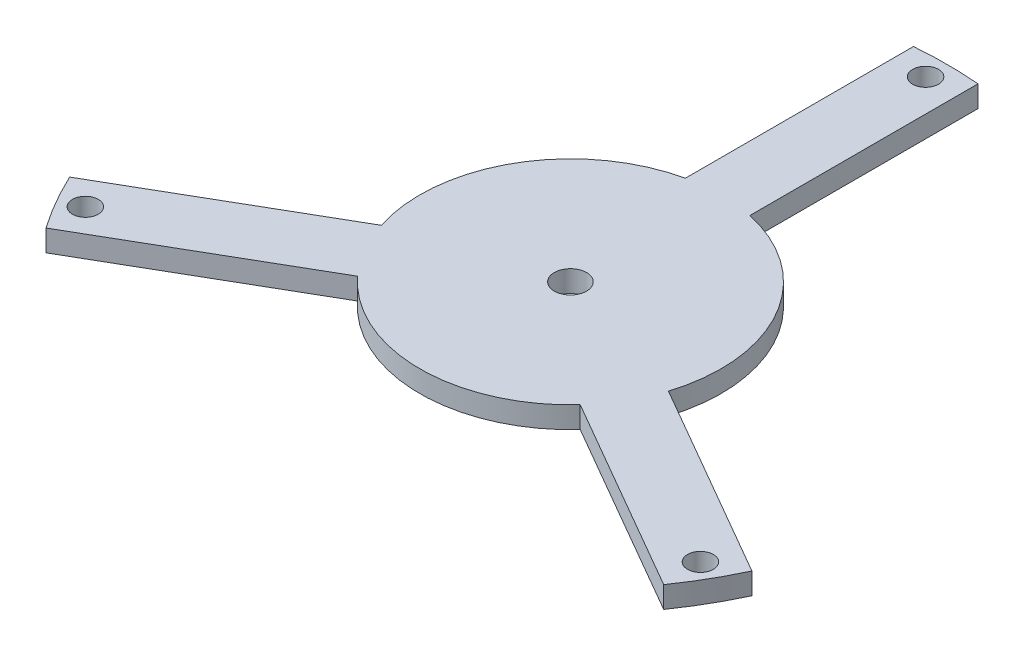
ISO-10303-21;
HEADER;
FILE_DESCRIPTION(('STEP AP214'),'2;1');
FILE_NAME('part.step','',(''),(''),'','','');
FILE_SCHEMA(('AUTOMOTIVE_DESIGN { 1 0 10303 214 1 1 1 1 }'));
ENDSEC;
DATA;
#1=APPLICATION_CONTEXT('core data for automotive mechanical design processes');
#2=APPLICATION_PROTOCOL_DEFINITION('international standard','automotive_design',2000,#1);
#3=PRODUCT_CONTEXT('',#1,'mechanical');
#4=PRODUCT('Part','Part','',(#3));
#5=PRODUCT_RELATED_PRODUCT_CATEGORY('part','',(#4));
#6=PRODUCT_DEFINITION_FORMATION('','',#4);
#7=PRODUCT_DEFINITION_CONTEXT('part definition',#1,'design');
#8=PRODUCT_DEFINITION('design','',#6,#7);
#9=PRODUCT_DEFINITION_SHAPE('','',#8);
#10=(LENGTH_UNIT() NAMED_UNIT(*) SI_UNIT(.MILLI.,.METRE.));
#11=(NAMED_UNIT(*) PLANE_ANGLE_UNIT() SI_UNIT($,.RADIAN.));
#12=(NAMED_UNIT(*) SI_UNIT($,.STERADIAN.) SOLID_ANGLE_UNIT());
#13=UNCERTAINTY_MEASURE_WITH_UNIT(LENGTH_MEASURE(1.E-05),#10,'distance_accuracy_value','');
#14=(GEOMETRIC_REPRESENTATION_CONTEXT(3) GLOBAL_UNCERTAINTY_ASSIGNED_CONTEXT((#13)) GLOBAL_UNIT_ASSIGNED_CONTEXT((#10,
#11,#12)) REPRESENTATION_CONTEXT('',''));
#15=CARTESIAN_POINT('',(0.,0.,0.));
#16=DIRECTION('',(0.,0.,1.));
#17=DIRECTION('',(1.,0.,0.));
#18=AXIS2_PLACEMENT_3D('',#15,#16,#17);
#19=CARTESIAN_POINT('',(0.,10.,0.));
#20=DIRECTION('',(0.,1.,0.));
#21=DIRECTION('',(0.,0.,1.));
#22=AXIS2_PLACEMENT_3D('',#19,#20,#21);
#23=PLANE('',#22);
#24=CARTESIAN_POINT('',(0.,10.,0.));
#25=DIRECTION('',(0.,1.,0.));
#26=DIRECTION('',(0.,0.,1.));
#27=AXIS2_PLACEMENT_3D('',#24,#25,#26);
#28=CIRCLE('',#27,7.5);
#29=CARTESIAN_POINT('',(0.,10.,7.5));
#30=VERTEX_POINT('',#29);
#31=EDGE_CURVE('E287',#30,#30,#28,.T.);
#32=ORIENTED_EDGE('',*,*,#31,.F.);
#33=EDGE_LOOP('',(#32));
#34=FACE_BOUND('',#33,.T.);
#35=CARTESIAN_POINT('',(142.894191624441,10.,82.4999999999948));
#36=DIRECTION('',(0.,1.,0.));
#37=DIRECTION('',(0.,0.,1.));
#38=AXIS2_PLACEMENT_3D('',#35,#36,#37);
#39=CIRCLE('',#38,6.00000000000002);
#40=CARTESIAN_POINT('',(142.894191624441,10.,88.4999999999949));
#41=VERTEX_POINT('',#40);
#42=EDGE_CURVE('E298',#41,#41,#39,.T.);
#43=ORIENTED_EDGE('',*,*,#42,.F.);
#44=EDGE_LOOP('',(#43));
#45=FACE_BOUND('',#44,.T.);
#46=CARTESIAN_POINT('',(0.,10.,0.));
#47=DIRECTION('',(0.,1.,0.));
#48=DIRECTION('',(0.,0.,1.));
#49=AXIS2_PLACEMENT_3D('',#46,#47,#48);
#50=CIRCLE('',#49,175.);
#51=CARTESIAN_POINT('',(-158.496688705413,10.,74.1875978140517));
#52=VERTEX_POINT('',#51);
#53=CARTESIAN_POINT('',(-143.496688705412,10.,100.168359927584));
#54=VERTEX_POINT('',#53);
#55=EDGE_CURVE('E179',#52,#54,#50,.T.);
#56=ORIENTED_EDGE('',*,*,#55,.T.);
#57=DIRECTION('',(0.866025403784439,0.,-0.5));
#58=VECTOR('',#57,1.);
#59=CARTESIAN_POINT('',(-143.496688705412,10.,100.168359927584));
#60=LINE('',#59,#58);
#61=CARTESIAN_POINT('',(-51.7135964116314,10.,47.177366884714));
#62=VERTEX_POINT('',#61);
#63=EDGE_CURVE('E107',#54,#62,#60,.T.);
#64=ORIENTED_EDGE('',*,*,#63,.T.);
#65=CARTESIAN_POINT('',(0.,10.,0.));
#66=DIRECTION('',(0.,1.,0.));
#67=DIRECTION('',(0.,0.,1.));
#68=AXIS2_PLACEMENT_3D('',#65,#66,#67);
#69=CIRCLE('',#68,70.);
#70=CARTESIAN_POINT('',(51.7135964116392,10.,47.1773668847054));
#71=VERTEX_POINT('',#70);
#72=EDGE_CURVE('E206',#62,#71,#69,.T.);
#73=ORIENTED_EDGE('',*,*,#72,.T.);
#74=DIRECTION('',(0.866025403784439,0.,0.499999999999999));
#75=VECTOR('',#74,1.);
#76=CARTESIAN_POINT('',(143.496688705418,10.,100.168359927575));
#77=LINE('',#76,#75);
#78=CARTESIAN_POINT('',(143.496688705418,10.,100.168359927575));
#79=VERTEX_POINT('',#78);
#80=EDGE_CURVE('E225',#71,#79,#77,.T.);
#81=ORIENTED_EDGE('',*,*,#80,.T.);
#82=CARTESIAN_POINT('',(0.,10.,0.));
#83=DIRECTION('',(0.,1.,0.));
#84=DIRECTION('',(0.,0.,1.));
#85=AXIS2_PLACEMENT_3D('',#82,#83,#84);
#86=CIRCLE('',#85,175.);
#87=CARTESIAN_POINT('',(158.496688705418,10.,74.1875978140414));
#88=VERTEX_POINT('',#87);
#89=EDGE_CURVE('E222',#79,#88,#86,.T.);
#90=ORIENTED_EDGE('',*,*,#89,.T.);
#91=DIRECTION('',(-0.866025403784439,0.,-0.5));
#92=VECTOR('',#91,1.);
#93=CARTESIAN_POINT('',(158.496688705418,10.,74.1875978140414));
#94=LINE('',#93,#92);
#95=CARTESIAN_POINT('',(66.7135964116369,10.,21.1966047711709));
#96=VERTEX_POINT('',#95);
#97=EDGE_CURVE('E224',#88,#96,#94,.T.);
#98=ORIENTED_EDGE('',*,*,#97,.T.);
#99=CARTESIAN_POINT('',(0.,10.,0.));
#100=DIRECTION('',(0.,1.,0.));
#101=DIRECTION('',(0.,0.,1.));
#102=AXIS2_PLACEMENT_3D('',#99,#100,#101);
#103=CIRCLE('',#102,70.);
#104=CARTESIAN_POINT('',(15.,10.,-68.3739716558867));
#105=VERTEX_POINT('',#104);
#106=EDGE_CURVE('E227',#96,#105,#103,.T.);
#107=ORIENTED_EDGE('',*,*,#106,.T.);
#108=DIRECTION('',(0.,0.,-1.));
#109=VECTOR('',#108,1.);
#110=CARTESIAN_POINT('',(15.,10.,-174.355957741627));
#111=LINE('',#110,#109);
#112=CARTESIAN_POINT('',(15.,10.,-174.355957741627));
#113=VERTEX_POINT('',#112);
#114=EDGE_CURVE('E233',#105,#113,#111,.T.);
#115=ORIENTED_EDGE('',*,*,#114,.T.);
#116=CARTESIAN_POINT('',(0.,10.,0.));
#117=DIRECTION('',(0.,1.,0.));
#118=DIRECTION('',(0.,0.,1.));
#119=AXIS2_PLACEMENT_3D('',#116,#117,#118);
#120=CIRCLE('',#119,175.);
#121=CARTESIAN_POINT('',(-15.,10.,-174.355957741627));
#122=VERTEX_POINT('',#121);
#123=EDGE_CURVE('E138',#113,#122,#120,.T.);
#124=ORIENTED_EDGE('',*,*,#123,.T.);
#125=DIRECTION('',(0.,0.,1.));
#126=VECTOR('',#125,1.);
#127=CARTESIAN_POINT('',(-15.,10.,-174.355957741627));
#128=LINE('',#127,#126);
#129=CARTESIAN_POINT('',(-15.,10.,-68.3739716558867));
#130=VERTEX_POINT('',#129);
#131=EDGE_CURVE('E132',#122,#130,#128,.T.);
#132=ORIENTED_EDGE('',*,*,#131,.T.);
#133=CARTESIAN_POINT('',(0.,10.,0.));
#134=DIRECTION('',(0.,1.,0.));
#135=DIRECTION('',(0.,0.,1.));
#136=AXIS2_PLACEMENT_3D('',#133,#134,#135);
#137=CIRCLE('',#136,70.);
#138=CARTESIAN_POINT('',(-66.7135964116334,10.,21.1966047711819));
#139=VERTEX_POINT('',#138);
#140=EDGE_CURVE('E136',#130,#139,#137,.T.);
#141=ORIENTED_EDGE('',*,*,#140,.T.);
#142=DIRECTION('',(-0.866025403784438,0.,0.5));
#143=VECTOR('',#142,1.);
#144=CARTESIAN_POINT('',(-158.496688705413,10.,74.1875978140517));
#145=LINE('',#144,#143);
#146=EDGE_CURVE('E52',#139,#52,#145,.T.);
#147=ORIENTED_EDGE('',*,*,#146,.T.);
#148=EDGE_LOOP('',(#56,#64,#73,#81,#90,#98,#107,#115,#124,#132,#141,#147));
#149=FACE_BOUND('',#148,.T.);
#150=CARTESIAN_POINT('',(0.,10.,-165.));
#151=DIRECTION('',(0.,1.,0.));
#152=DIRECTION('',(0.,0.,1.));
#153=AXIS2_PLACEMENT_3D('',#150,#151,#152);
#154=CIRCLE('',#153,6.);
#155=CARTESIAN_POINT('',(0.,10.,-159.));
#156=VERTEX_POINT('',#155);
#157=EDGE_CURVE('E160',#156,#156,#154,.T.);
#158=ORIENTED_EDGE('',*,*,#157,.F.);
#159=EDGE_LOOP('',(#158));
#160=FACE_BOUND('',#159,.T.);
#161=CARTESIAN_POINT('',(-142.894191624423,10.,82.5000000000052));
#162=DIRECTION('',(0.,1.,0.));
#163=DIRECTION('',(0.,0.,1.));
#164=AXIS2_PLACEMENT_3D('',#161,#162,#163);
#165=CIRCLE('',#164,6.00000000000002);
#166=CARTESIAN_POINT('',(-142.894191624423,10.,88.5000000000052));
#167=VERTEX_POINT('',#166);
#168=EDGE_CURVE('E292',#167,#167,#165,.T.);
#169=ORIENTED_EDGE('',*,*,#168,.F.);
#170=EDGE_LOOP('',(#169));
#171=FACE_BOUND('',#170,.T.);
#172=ADVANCED_FACE('F35',(#34,#45,#149,#160,#171),#23,.T.);
#173=CARTESIAN_POINT('',(0.,0.,0.));
#174=DIRECTION('',(0.,1.,0.));
#175=DIRECTION('',(0.,0.,1.));
#176=AXIS2_PLACEMENT_3D('',#173,#174,#175);
#177=PLANE('',#176);
#178=CARTESIAN_POINT('',(0.,0.,0.));
#179=DIRECTION('',(0.,1.,0.));
#180=DIRECTION('',(0.,0.,1.));
#181=AXIS2_PLACEMENT_3D('',#178,#179,#180);
#182=CIRCLE('',#181,7.5);
#183=CARTESIAN_POINT('',(0.,0.,7.5));
#184=VERTEX_POINT('',#183);
#185=EDGE_CURVE('E285',#184,#184,#182,.T.);
#186=ORIENTED_EDGE('',*,*,#185,.T.);
#187=EDGE_LOOP('',(#186));
#188=FACE_BOUND('',#187,.T.);
#189=CARTESIAN_POINT('',(142.894191624441,0.,82.4999999999948));
#190=DIRECTION('',(0.,1.,0.));
#191=DIRECTION('',(0.,0.,1.));
#192=AXIS2_PLACEMENT_3D('',#189,#190,#191);
#193=CIRCLE('',#192,6.00000000000002);
#194=CARTESIAN_POINT('',(142.894191624441,0.,88.4999999999949));
#195=VERTEX_POINT('',#194);
#196=EDGE_CURVE('E295',#195,#195,#193,.T.);
#197=ORIENTED_EDGE('',*,*,#196,.T.);
#198=EDGE_LOOP('',(#197));
#199=FACE_BOUND('',#198,.T.);
#200=CARTESIAN_POINT('',(0.,0.,0.));
#201=DIRECTION('',(0.,1.,0.));
#202=DIRECTION('',(0.,0.,1.));
#203=AXIS2_PLACEMENT_3D('',#200,#201,#202);
#204=CIRCLE('',#203,175.);
#205=CARTESIAN_POINT('',(-158.496688705413,0.,74.1875978140517));
#206=VERTEX_POINT('',#205);
#207=CARTESIAN_POINT('',(-143.496688705412,0.,100.168359927584));
#208=VERTEX_POINT('',#207);
#209=EDGE_CURVE('E156',#206,#208,#204,.T.);
#210=ORIENTED_EDGE('',*,*,#209,.F.);
#211=DIRECTION('',(-0.866025403784438,0.,0.5));
#212=VECTOR('',#211,1.);
#213=CARTESIAN_POINT('',(-158.496688705413,0.,74.1875978140517));
#214=LINE('',#213,#212);
#215=CARTESIAN_POINT('',(-66.7135964116334,0.,21.1966047711819));
#216=VERTEX_POINT('',#215);
#217=EDGE_CURVE('E99',#216,#206,#214,.T.);
#218=ORIENTED_EDGE('',*,*,#217,.F.);
#219=CARTESIAN_POINT('',(0.,0.,0.));
#220=DIRECTION('',(0.,1.,0.));
#221=DIRECTION('',(0.,0.,1.));
#222=AXIS2_PLACEMENT_3D('',#219,#220,#221);
#223=CIRCLE('',#222,70.);
#224=CARTESIAN_POINT('',(-15.,0.,-68.3739716558867));
#225=VERTEX_POINT('',#224);
#226=EDGE_CURVE('E93',#225,#216,#223,.T.);
#227=ORIENTED_EDGE('',*,*,#226,.F.);
#228=DIRECTION('',(0.,0.,1.));
#229=VECTOR('',#228,1.);
#230=CARTESIAN_POINT('',(-15.,0.,-174.355957741627));
#231=LINE('',#230,#229);
#232=CARTESIAN_POINT('',(-15.,0.,-174.355957741627));
#233=VERTEX_POINT('',#232);
#234=EDGE_CURVE('E146',#233,#225,#231,.T.);
#235=ORIENTED_EDGE('',*,*,#234,.F.);
#236=CARTESIAN_POINT('',(0.,0.,0.));
#237=DIRECTION('',(0.,1.,0.));
#238=DIRECTION('',(0.,0.,1.));
#239=AXIS2_PLACEMENT_3D('',#236,#237,#238);
#240=CIRCLE('',#239,175.);
#241=CARTESIAN_POINT('',(15.,0.,-174.355957741627));
#242=VERTEX_POINT('',#241);
#243=EDGE_CURVE('E174',#242,#233,#240,.T.);
#244=ORIENTED_EDGE('',*,*,#243,.F.);
#245=DIRECTION('',(0.,0.,-1.));
#246=VECTOR('',#245,1.);
#247=CARTESIAN_POINT('',(15.,0.,-174.355957741627));
#248=LINE('',#247,#246);
#249=CARTESIAN_POINT('',(15.,0.,-68.3739716558867));
#250=VERTEX_POINT('',#249);
#251=EDGE_CURVE('E172',#250,#242,#248,.T.);
#252=ORIENTED_EDGE('',*,*,#251,.F.);
#253=CARTESIAN_POINT('',(0.,0.,0.));
#254=DIRECTION('',(0.,1.,0.));
#255=DIRECTION('',(0.,0.,1.));
#256=AXIS2_PLACEMENT_3D('',#253,#254,#255);
#257=CIRCLE('',#256,70.);
#258=CARTESIAN_POINT('',(66.7135964116369,0.,21.1966047711709));
#259=VERTEX_POINT('',#258);
#260=EDGE_CURVE('E170',#259,#250,#257,.T.);
#261=ORIENTED_EDGE('',*,*,#260,.F.);
#262=DIRECTION('',(-0.866025403784439,0.,-0.5));
#263=VECTOR('',#262,1.);
#264=CARTESIAN_POINT('',(158.496688705418,0.,74.1875978140414));
#265=LINE('',#264,#263);
#266=CARTESIAN_POINT('',(158.496688705418,0.,74.1875978140414));
#267=VERTEX_POINT('',#266);
#268=EDGE_CURVE('E168',#267,#259,#265,.T.);
#269=ORIENTED_EDGE('',*,*,#268,.F.);
#270=CARTESIAN_POINT('',(0.,0.,0.));
#271=DIRECTION('',(0.,1.,0.));
#272=DIRECTION('',(0.,0.,1.));
#273=AXIS2_PLACEMENT_3D('',#270,#271,#272);
#274=CIRCLE('',#273,175.);
#275=CARTESIAN_POINT('',(143.496688705418,0.,100.168359927575));
#276=VERTEX_POINT('',#275);
#277=EDGE_CURVE('E166',#276,#267,#274,.T.);
#278=ORIENTED_EDGE('',*,*,#277,.F.);
#279=DIRECTION('',(0.866025403784439,0.,0.499999999999999));
#280=VECTOR('',#279,1.);
#281=CARTESIAN_POINT('',(143.496688705418,0.,100.168359927575));
#282=LINE('',#281,#280);
#283=CARTESIAN_POINT('',(51.7135964116392,0.,47.1773668847054));
#284=VERTEX_POINT('',#283);
#285=EDGE_CURVE('E164',#284,#276,#282,.T.);
#286=ORIENTED_EDGE('',*,*,#285,.F.);
#287=CARTESIAN_POINT('',(0.,0.,0.));
#288=DIRECTION('',(0.,1.,0.));
#289=DIRECTION('',(0.,0.,1.));
#290=AXIS2_PLACEMENT_3D('',#287,#288,#289);
#291=CIRCLE('',#290,70.);
#292=CARTESIAN_POINT('',(-51.7135964116314,0.,47.177366884714));
#293=VERTEX_POINT('',#292);
#294=EDGE_CURVE('E162',#293,#284,#291,.T.);
#295=ORIENTED_EDGE('',*,*,#294,.F.);
#296=DIRECTION('',(0.866025403784439,0.,-0.5));
#297=VECTOR('',#296,1.);
#298=CARTESIAN_POINT('',(-143.496688705412,0.,100.168359927584));
#299=LINE('',#298,#297);
#300=EDGE_CURVE('E159',#208,#293,#299,.T.);
#301=ORIENTED_EDGE('',*,*,#300,.F.);
#302=EDGE_LOOP('',(#210,#218,#227,#235,#244,#252,#261,#269,#278,#286,#295,#301));
#303=FACE_BOUND('',#302,.T.);
#304=CARTESIAN_POINT('',(0.,0.,-165.));
#305=DIRECTION('',(0.,1.,0.));
#306=DIRECTION('',(0.,0.,1.));
#307=AXIS2_PLACEMENT_3D('',#304,#305,#306);
#308=CIRCLE('',#307,6.);
#309=CARTESIAN_POINT('',(0.,0.,-159.));
#310=VERTEX_POINT('',#309);
#311=EDGE_CURVE('E301',#310,#310,#308,.T.);
#312=ORIENTED_EDGE('',*,*,#311,.T.);
#313=EDGE_LOOP('',(#312));
#314=FACE_BOUND('',#313,.T.);
#315=CARTESIAN_POINT('',(-142.894191624423,0.,82.5000000000052));
#316=DIRECTION('',(0.,1.,0.));
#317=DIRECTION('',(0.,0.,1.));
#318=AXIS2_PLACEMENT_3D('',#315,#316,#317);
#319=CIRCLE('',#318,6.00000000000002);
#320=CARTESIAN_POINT('',(-142.894191624423,0.,88.5000000000052));
#321=VERTEX_POINT('',#320);
#322=EDGE_CURVE('E289',#321,#321,#319,.T.);
#323=ORIENTED_EDGE('',*,*,#322,.T.);
#324=EDGE_LOOP('',(#323));
#325=FACE_BOUND('',#324,.T.);
#326=ADVANCED_FACE('F210',(#188,#199,#303,#314,#325),#177,.F.);
#327=CARTESIAN_POINT('',(0.,10.,0.));
#328=DIRECTION('',(0.,-1.,0.));
#329=DIRECTION('',(0.,0.,-1.));
#330=AXIS2_PLACEMENT_3D('',#327,#328,#329);
#331=CYLINDRICAL_SURFACE('',#330,175.);
#332=ORIENTED_EDGE('',*,*,#209,.T.);
#333=DIRECTION('',(0.,-1.,0.));
#334=VECTOR('',#333,1.);
#335=CARTESIAN_POINT('',(-143.496688705412,10.,100.168359927584));
#336=LINE('',#335,#334);
#337=EDGE_CURVE('E11',#54,#208,#336,.T.);
#338=ORIENTED_EDGE('',*,*,#337,.F.);
#339=ORIENTED_EDGE('',*,*,#55,.F.);
#340=DIRECTION('',(0.,-1.,0.));
#341=VECTOR('',#340,1.);
#342=CARTESIAN_POINT('',(-158.496688705413,10.,74.1875978140517));
#343=LINE('',#342,#341);
#344=EDGE_CURVE('E152',#52,#206,#343,.T.);
#345=ORIENTED_EDGE('',*,*,#344,.T.);
#346=EDGE_LOOP('',(#332,#338,#339,#345));
#347=FACE_BOUND('',#346,.T.);
#348=ADVANCED_FACE('F37',(#347),#331,.T.);
#349=CARTESIAN_POINT('',(-143.496688705412,10.,100.168359927584));
#350=DIRECTION('',(-0.5,0.,-0.866025403784439));
#351=DIRECTION('',(-0.866025403784439,0.,0.5));
#352=AXIS2_PLACEMENT_3D('',#349,#350,#351);
#353=PLANE('',#352);
#354=ORIENTED_EDGE('',*,*,#300,.T.);
#355=DIRECTION('',(0.,-1.,0.));
#356=VECTOR('',#355,1.);
#357=CARTESIAN_POINT('',(-51.7135964116314,10.,47.177366884714));
#358=LINE('',#357,#356);
#359=EDGE_CURVE('E44',#62,#293,#358,.T.);
#360=ORIENTED_EDGE('',*,*,#359,.F.);
#361=ORIENTED_EDGE('',*,*,#63,.F.);
#362=ORIENTED_EDGE('',*,*,#337,.T.);
#363=EDGE_LOOP('',(#354,#360,#361,#362));
#364=FACE_BOUND('',#363,.T.);
#365=ADVANCED_FACE('F413',(#364),#353,.F.);
#366=CARTESIAN_POINT('',(0.,10.,0.));
#367=DIRECTION('',(0.,-1.,0.));
#368=DIRECTION('',(0.,0.,-1.));
#369=AXIS2_PLACEMENT_3D('',#366,#367,#368);
#370=CYLINDRICAL_SURFACE('',#369,70.);
#371=ORIENTED_EDGE('',*,*,#294,.T.);
#372=DIRECTION('',(0.,-1.,0.));
#373=VECTOR('',#372,1.);
#374=CARTESIAN_POINT('',(51.7135964116392,10.,47.1773668847054));
#375=LINE('',#374,#373);
#376=EDGE_CURVE('E198',#71,#284,#375,.T.);
#377=ORIENTED_EDGE('',*,*,#376,.F.);
#378=ORIENTED_EDGE('',*,*,#72,.F.);
#379=ORIENTED_EDGE('',*,*,#359,.T.);
#380=EDGE_LOOP('',(#371,#377,#378,#379));
#381=FACE_BOUND('',#380,.T.);
#382=ADVANCED_FACE('F204',(#381),#370,.T.);
#383=CARTESIAN_POINT('',(143.496688705418,10.,100.168359927575));
#384=DIRECTION('',(0.5,0.,-0.866025403784439));
#385=DIRECTION('',(-0.866025403784439,0.,-0.5));
#386=AXIS2_PLACEMENT_3D('',#383,#384,#385);
#387=PLANE('',#386);
#388=ORIENTED_EDGE('',*,*,#285,.T.);
#389=DIRECTION('',(0.,-1.,0.));
#390=VECTOR('',#389,1.);
#391=CARTESIAN_POINT('',(143.496688705418,10.,100.168359927575));
#392=LINE('',#391,#390);
#393=EDGE_CURVE('E195',#79,#276,#392,.T.);
#394=ORIENTED_EDGE('',*,*,#393,.F.);
#395=ORIENTED_EDGE('',*,*,#80,.F.);
#396=ORIENTED_EDGE('',*,*,#376,.T.);
#397=EDGE_LOOP('',(#388,#394,#395,#396));
#398=FACE_BOUND('',#397,.T.);
#399=ADVANCED_FACE('F216',(#398),#387,.F.);
#400=CARTESIAN_POINT('',(0.,10.,0.));
#401=DIRECTION('',(0.,-1.,0.));
#402=DIRECTION('',(0.,0.,-1.));
#403=AXIS2_PLACEMENT_3D('',#400,#401,#402);
#404=CYLINDRICAL_SURFACE('',#403,175.);
#405=ORIENTED_EDGE('',*,*,#277,.T.);
#406=DIRECTION('',(0.,-1.,0.));
#407=VECTOR('',#406,1.);
#408=CARTESIAN_POINT('',(158.496688705418,10.,74.1875978140414));
#409=LINE('',#408,#407);
#410=EDGE_CURVE('E192',#88,#267,#409,.T.);
#411=ORIENTED_EDGE('',*,*,#410,.F.);
#412=ORIENTED_EDGE('',*,*,#89,.F.);
#413=ORIENTED_EDGE('',*,*,#393,.T.);
#414=EDGE_LOOP('',(#405,#411,#412,#413));
#415=FACE_BOUND('',#414,.T.);
#416=ADVANCED_FACE('F220',(#415),#404,.T.);
#417=CARTESIAN_POINT('',(158.496688705418,10.,74.1875978140414));
#418=DIRECTION('',(-0.5,0.,0.866025403784439));
#419=DIRECTION('',(0.866025403784439,0.,0.5));
#420=AXIS2_PLACEMENT_3D('',#417,#418,#419);
#421=PLANE('',#420);
#422=ORIENTED_EDGE('',*,*,#268,.T.);
#423=DIRECTION('',(0.,-1.,0.));
#424=VECTOR('',#423,1.);
#425=CARTESIAN_POINT('',(66.7135964116369,10.,21.1966047711709));
#426=LINE('',#425,#424);
#427=EDGE_CURVE('E189',#96,#259,#426,.T.);
#428=ORIENTED_EDGE('',*,*,#427,.F.);
#429=ORIENTED_EDGE('',*,*,#97,.F.);
#430=ORIENTED_EDGE('',*,*,#410,.T.);
#431=EDGE_LOOP('',(#422,#428,#429,#430));
#432=FACE_BOUND('',#431,.T.);
#433=ADVANCED_FACE('F378',(#432),#421,.F.);
#434=CARTESIAN_POINT('',(0.,10.,0.));
#435=DIRECTION('',(0.,-1.,0.));
#436=DIRECTION('',(0.,0.,-1.));
#437=AXIS2_PLACEMENT_3D('',#434,#435,#436);
#438=CYLINDRICAL_SURFACE('',#437,70.);
#439=ORIENTED_EDGE('',*,*,#260,.T.);
#440=DIRECTION('',(0.,-1.,0.));
#441=VECTOR('',#440,1.);
#442=CARTESIAN_POINT('',(15.,10.,-68.3739716558867));
#443=LINE('',#442,#441);
#444=EDGE_CURVE('E186',#105,#250,#443,.T.);
#445=ORIENTED_EDGE('',*,*,#444,.F.);
#446=ORIENTED_EDGE('',*,*,#106,.F.);
#447=ORIENTED_EDGE('',*,*,#427,.T.);
#448=EDGE_LOOP('',(#439,#445,#446,#447));
#449=FACE_BOUND('',#448,.T.);
#450=ADVANCED_FACE('F369',(#449),#438,.T.);
#451=CARTESIAN_POINT('',(15.,10.,-174.355957741627));
#452=DIRECTION('',(-1.,0.,0.));
#453=DIRECTION('',(0.,0.,1.));
#454=AXIS2_PLACEMENT_3D('',#451,#452,#453);
#455=PLANE('',#454);
#456=ORIENTED_EDGE('',*,*,#251,.T.);
#457=DIRECTION('',(0.,-1.,0.));
#458=VECTOR('',#457,1.);
#459=CARTESIAN_POINT('',(15.,10.,-174.355957741627));
#460=LINE('',#459,#458);
#461=EDGE_CURVE('E183',#113,#242,#460,.T.);
#462=ORIENTED_EDGE('',*,*,#461,.F.);
#463=ORIENTED_EDGE('',*,*,#114,.F.);
#464=ORIENTED_EDGE('',*,*,#444,.T.);
#465=EDGE_LOOP('',(#456,#462,#463,#464));
#466=FACE_BOUND('',#465,.T.);
#467=ADVANCED_FACE('F239',(#466),#455,.F.);
#468=CARTESIAN_POINT('',(0.,10.,0.));
#469=DIRECTION('',(0.,-1.,0.));
#470=DIRECTION('',(0.,0.,-1.));
#471=AXIS2_PLACEMENT_3D('',#468,#469,#470);
#472=CYLINDRICAL_SURFACE('',#471,175.);
#473=ORIENTED_EDGE('',*,*,#243,.T.);
#474=DIRECTION('',(0.,-1.,0.));
#475=VECTOR('',#474,1.);
#476=CARTESIAN_POINT('',(-15.,10.,-174.355957741627));
#477=LINE('',#476,#475);
#478=EDGE_CURVE('E147',#122,#233,#477,.T.);
#479=ORIENTED_EDGE('',*,*,#478,.F.);
#480=ORIENTED_EDGE('',*,*,#123,.F.);
#481=ORIENTED_EDGE('',*,*,#461,.T.);
#482=EDGE_LOOP('',(#473,#479,#480,#481));
#483=FACE_BOUND('',#482,.T.);
#484=ADVANCED_FACE('F243',(#483),#472,.T.);
#485=CARTESIAN_POINT('',(-15.,10.,-174.355957741627));
#486=DIRECTION('',(1.,0.,0.));
#487=DIRECTION('',(0.,0.,-1.));
#488=AXIS2_PLACEMENT_3D('',#485,#486,#487);
#489=PLANE('',#488);
#490=ORIENTED_EDGE('',*,*,#234,.T.);
#491=DIRECTION('',(0.,-1.,0.));
#492=VECTOR('',#491,1.);
#493=CARTESIAN_POINT('',(-15.,10.,-68.3739716558867));
#494=LINE('',#493,#492);
#495=EDGE_CURVE('E143',#130,#225,#494,.T.);
#496=ORIENTED_EDGE('',*,*,#495,.F.);
#497=ORIENTED_EDGE('',*,*,#131,.F.);
#498=ORIENTED_EDGE('',*,*,#478,.T.);
#499=EDGE_LOOP('',(#490,#496,#497,#498));
#500=FACE_BOUND('',#499,.T.);
#501=ADVANCED_FACE('F144',(#500),#489,.F.);
#502=CARTESIAN_POINT('',(0.,10.,0.));
#503=DIRECTION('',(0.,-1.,0.));
#504=DIRECTION('',(0.,0.,-1.));
#505=AXIS2_PLACEMENT_3D('',#502,#503,#504);
#506=CYLINDRICAL_SURFACE('',#505,70.);
#507=ORIENTED_EDGE('',*,*,#226,.T.);
#508=DIRECTION('',(0.,-1.,0.));
#509=VECTOR('',#508,1.);
#510=CARTESIAN_POINT('',(-66.7135964116334,10.,21.1966047711819));
#511=LINE('',#510,#509);
#512=EDGE_CURVE('E148',#139,#216,#511,.T.);
#513=ORIENTED_EDGE('',*,*,#512,.F.);
#514=ORIENTED_EDGE('',*,*,#140,.F.);
#515=ORIENTED_EDGE('',*,*,#495,.T.);
#516=EDGE_LOOP('',(#507,#513,#514,#515));
#517=FACE_BOUND('',#516,.T.);
#518=ADVANCED_FACE('F150',(#517),#506,.T.);
#519=CARTESIAN_POINT('',(-158.496688705413,10.,74.1875978140517));
#520=DIRECTION('',(0.5,0.,0.866025403784438));
#521=DIRECTION('',(0.866025403784438,0.,-0.5));
#522=AXIS2_PLACEMENT_3D('',#519,#520,#521);
#523=PLANE('',#522);
#524=ORIENTED_EDGE('',*,*,#217,.T.);
#525=ORIENTED_EDGE('',*,*,#344,.F.);
#526=ORIENTED_EDGE('',*,*,#146,.F.);
#527=ORIENTED_EDGE('',*,*,#512,.T.);
#528=EDGE_LOOP('',(#524,#525,#526,#527));
#529=FACE_BOUND('',#528,.T.);
#530=ADVANCED_FACE('F247',(#529),#523,.F.);
#531=CARTESIAN_POINT('',(0.,10.,-165.));
#532=DIRECTION('',(0.,-1.,0.));
#533=DIRECTION('',(0.,0.,-1.));
#534=AXIS2_PLACEMENT_3D('',#531,#532,#533);
#535=CYLINDRICAL_SURFACE('',#534,6.);
#536=ORIENTED_EDGE('',*,*,#157,.T.);
#537=EDGE_LOOP('',(#536));
#538=FACE_BOUND('',#537,.T.);
#539=ORIENTED_EDGE('',*,*,#311,.F.);
#540=EDGE_LOOP('',(#539));
#541=FACE_BOUND('',#540,.T.);
#542=ADVANCED_FACE('F249',(#538,#541),#535,.F.);
#543=CARTESIAN_POINT('',(142.894191624441,10.,82.4999999999948));
#544=DIRECTION('',(0.,-1.,0.));
#545=DIRECTION('',(0.,0.,-1.));
#546=AXIS2_PLACEMENT_3D('',#543,#544,#545);
#547=CYLINDRICAL_SURFACE('',#546,6.00000000000002);
#548=ORIENTED_EDGE('',*,*,#42,.T.);
#549=EDGE_LOOP('',(#548));
#550=FACE_BOUND('',#549,.T.);
#551=ORIENTED_EDGE('',*,*,#196,.F.);
#552=EDGE_LOOP('',(#551));
#553=FACE_BOUND('',#552,.T.);
#554=ADVANCED_FACE('F255',(#550,#553),#547,.F.);
#555=CARTESIAN_POINT('',(-142.894191624423,10.,82.5000000000052));
#556=DIRECTION('',(0.,-1.,0.));
#557=DIRECTION('',(0.,0.,-1.));
#558=AXIS2_PLACEMENT_3D('',#555,#556,#557);
#559=CYLINDRICAL_SURFACE('',#558,6.00000000000002);
#560=ORIENTED_EDGE('',*,*,#168,.T.);
#561=EDGE_LOOP('',(#560));
#562=FACE_BOUND('',#561,.T.);
#563=ORIENTED_EDGE('',*,*,#322,.F.);
#564=EDGE_LOOP('',(#563));
#565=FACE_BOUND('',#564,.T.);
#566=ADVANCED_FACE('F272',(#562,#565),#559,.F.);
#567=CARTESIAN_POINT('',(0.,0.,0.));
#568=DIRECTION('',(0.,1.,0.));
#569=DIRECTION('',(0.,0.,1.));
#570=AXIS2_PLACEMENT_3D('',#567,#568,#569);
#571=CYLINDRICAL_SURFACE('',#570,7.5);
#572=ORIENTED_EDGE('',*,*,#185,.F.);
#573=EDGE_LOOP('',(#572));
#574=FACE_BOUND('',#573,.T.);
#575=ORIENTED_EDGE('',*,*,#31,.T.);
#576=EDGE_LOOP('',(#575));
#577=FACE_BOUND('',#576,.T.);
#578=ADVANCED_FACE('F276',(#574,#577),#571,.F.);
#579=CLOSED_SHELL('',(#172,#326,#348,#365,#382,#399,#416,#433,#450,#467,#484,#501,#518,#530,
#542,#554,#566,#578));
#580=MANIFOLD_SOLID_BREP('B2',#579);
#581=ADVANCED_BREP_SHAPE_REPRESENTATION('',(#18,#580),#14);
#582=SHAPE_DEFINITION_REPRESENTATION(#9,#581);
ENDSEC;
END-ISO-10303-21;
